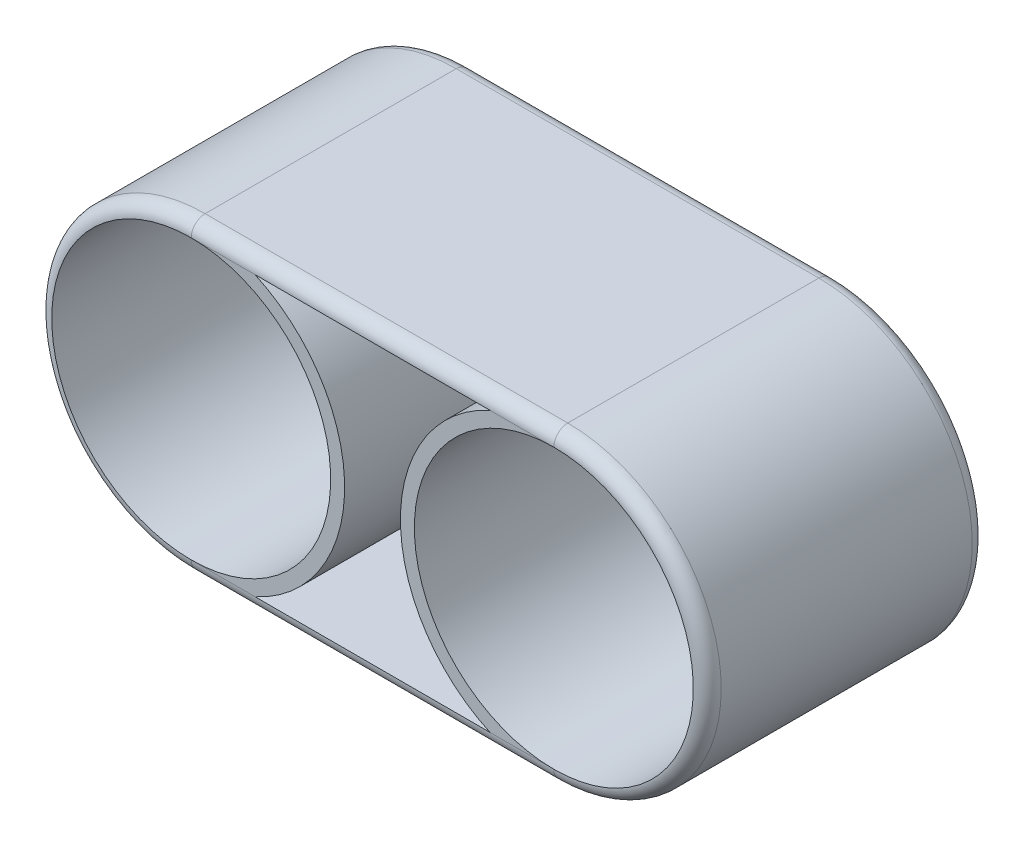
ISO-10303-21;
HEADER;
FILE_DESCRIPTION(('STEP AP214'),'2;1');
FILE_NAME('part.step','',(''),(''),'','','');
FILE_SCHEMA(('AUTOMOTIVE_DESIGN { 1 0 10303 214 1 1 1 1 }'));
ENDSEC;
DATA;
#1=APPLICATION_CONTEXT('core data for automotive mechanical design processes');
#2=APPLICATION_PROTOCOL_DEFINITION('international standard','automotive_design',2000,#1);
#3=PRODUCT_CONTEXT('',#1,'mechanical');
#4=PRODUCT('Part','Part','',(#3));
#5=PRODUCT_RELATED_PRODUCT_CATEGORY('part','',(#4));
#6=PRODUCT_DEFINITION_FORMATION('','',#4);
#7=PRODUCT_DEFINITION_CONTEXT('part definition',#1,'design');
#8=PRODUCT_DEFINITION('design','',#6,#7);
#9=PRODUCT_DEFINITION_SHAPE('','',#8);
#10=(LENGTH_UNIT() NAMED_UNIT(*) SI_UNIT(.MILLI.,.METRE.));
#11=(NAMED_UNIT(*) PLANE_ANGLE_UNIT() SI_UNIT($,.RADIAN.));
#12=(NAMED_UNIT(*) SI_UNIT($,.STERADIAN.) SOLID_ANGLE_UNIT());
#13=UNCERTAINTY_MEASURE_WITH_UNIT(LENGTH_MEASURE(1.E-05),#10,'distance_accuracy_value','');
#14=(GEOMETRIC_REPRESENTATION_CONTEXT(3) GLOBAL_UNCERTAINTY_ASSIGNED_CONTEXT((#13)) GLOBAL_UNIT_ASSIGNED_CONTEXT((#10,
#11,#12)) REPRESENTATION_CONTEXT('',''));
#15=CARTESIAN_POINT('',(0.,0.,0.));
#16=DIRECTION('',(0.,0.,1.));
#17=DIRECTION('',(1.,0.,0.));
#18=AXIS2_PLACEMENT_3D('',#15,#16,#17);
#19=CARTESIAN_POINT('',(65.,0.,50.));
#20=DIRECTION('',(0.,0.,1.));
#21=DIRECTION('',(1.,0.,0.));
#22=AXIS2_PLACEMENT_3D('',#19,#20,#21);
#23=PLANE('',#22);
#24=CARTESIAN_POINT('',(65.,0.,50.));
#25=DIRECTION('',(0.,0.,1.));
#26=DIRECTION('',(1.,0.,0.));
#27=AXIS2_PLACEMENT_3D('',#24,#25,#26);
#28=CIRCLE('',#27,50.);
#29=CARTESIAN_POINT('',(65.,50.,50.));
#30=VERTEX_POINT('',#29);
#31=CARTESIAN_POINT('',(65.,-50.,50.));
#32=VERTEX_POINT('',#31);
#33=EDGE_CURVE('E125',#30,#32,#28,.T.);
#34=ORIENTED_EDGE('',*,*,#33,.F.);
#35=DIRECTION('',(-1.,0.,0.));
#36=VECTOR('',#35,1.);
#37=CARTESIAN_POINT('',(-65.,50.,50.));
#38=LINE('',#37,#36);
#39=CARTESIAN_POINT('',(42.0871215252207,50.,50.));
#40=VERTEX_POINT('',#39);
#41=EDGE_CURVE('E122',#30,#40,#38,.T.);
#42=ORIENTED_EDGE('',*,*,#41,.T.);
#43=CARTESIAN_POINT('',(65.,0.,50.));
#44=DIRECTION('',(0.,0.,-1.));
#45=DIRECTION('',(1.,0.,0.));
#46=AXIS2_PLACEMENT_3D('',#43,#44,#45);
#47=CIRCLE('',#46,55.);
#48=CARTESIAN_POINT('',(42.0871215252208,-50.,50.));
#49=VERTEX_POINT('',#48);
#50=EDGE_CURVE('E124',#49,#40,#47,.T.);
#51=ORIENTED_EDGE('',*,*,#50,.F.);
#52=DIRECTION('',(1.,0.,0.));
#53=VECTOR('',#52,1.);
#54=CARTESIAN_POINT('',(65.,-50.,50.));
#55=LINE('',#54,#53);
#56=EDGE_CURVE('E50',#49,#32,#55,.T.);
#57=ORIENTED_EDGE('',*,*,#56,.T.);
#58=EDGE_LOOP('',(#34,#42,#51,#57));
#59=FACE_BOUND('',#58,.T.);
#60=ADVANCED_FACE('F33',(#59),#23,.T.);
#61=CARTESIAN_POINT('',(65.,0.,-50.));
#62=DIRECTION('',(0.,0.,1.));
#63=DIRECTION('',(1.,0.,0.));
#64=AXIS2_PLACEMENT_3D('',#61,#62,#63);
#65=PLANE('',#64);
#66=CARTESIAN_POINT('',(-65.,0.,-50.));
#67=DIRECTION('',(0.,0.,1.));
#68=DIRECTION('',(1.,0.,0.));
#69=AXIS2_PLACEMENT_3D('',#66,#67,#68);
#70=CIRCLE('',#69,50.);
#71=CARTESIAN_POINT('',(-65.,-50.,-50.));
#72=VERTEX_POINT('',#71);
#73=CARTESIAN_POINT('',(-65.,50.,-50.));
#74=VERTEX_POINT('',#73);
#75=EDGE_CURVE('E268',#72,#74,#70,.T.);
#76=ORIENTED_EDGE('',*,*,#75,.T.);
#77=DIRECTION('',(-1.,0.,0.));
#78=VECTOR('',#77,1.);
#79=CARTESIAN_POINT('',(65.,50.,-50.));
#80=LINE('',#79,#78);
#81=CARTESIAN_POINT('',(-42.0871215252208,50.,-50.));
#82=VERTEX_POINT('',#81);
#83=EDGE_CURVE('E201',#74,#82,#80,.F.);
#84=ORIENTED_EDGE('',*,*,#83,.T.);
#85=CARTESIAN_POINT('',(-65.,0.,-50.));
#86=DIRECTION('',(0.,0.,-1.));
#87=DIRECTION('',(1.,0.,0.));
#88=AXIS2_PLACEMENT_3D('',#85,#86,#87);
#89=CIRCLE('',#88,55.);
#90=CARTESIAN_POINT('',(-42.0871215252208,-50.,-50.));
#91=VERTEX_POINT('',#90);
#92=EDGE_CURVE('E169',#82,#91,#89,.T.);
#93=ORIENTED_EDGE('',*,*,#92,.T.);
#94=DIRECTION('',(1.,0.,0.));
#95=VECTOR('',#94,1.);
#96=CARTESIAN_POINT('',(65.,-50.,-50.));
#97=LINE('',#96,#95);
#98=EDGE_CURVE('E195',#91,#72,#97,.F.);
#99=ORIENTED_EDGE('',*,*,#98,.T.);
#100=EDGE_LOOP('',(#76,#84,#93,#99));
#101=FACE_BOUND('',#100,.T.);
#102=ADVANCED_FACE('F304',(#101),#65,.F.);
#103=CARTESIAN_POINT('',(-65.,0.,50.));
#104=DIRECTION('',(0.,0.,-1.));
#105=DIRECTION('',(1.,0.,0.));
#106=AXIS2_PLACEMENT_3D('',#103,#104,#105);
#107=CIRCLE('',#106,55.);
#108=CARTESIAN_POINT('',(-42.0871215252208,50.,50.));
#109=VERTEX_POINT('',#108);
#110=CARTESIAN_POINT('',(-42.0871215252208,-50.,50.));
#111=VERTEX_POINT('',#110);
#112=EDGE_CURVE('E157',#109,#111,#107,.T.);
#113=ORIENTED_EDGE('',*,*,#112,.F.);
#114=DIRECTION('',(-1.,0.,0.));
#115=VECTOR('',#114,1.);
#116=CARTESIAN_POINT('',(-65.,50.,50.));
#117=LINE('',#116,#115);
#118=CARTESIAN_POINT('',(-65.,50.,50.));
#119=VERTEX_POINT('',#118);
#120=EDGE_CURVE('E130',#109,#119,#117,.T.);
#121=ORIENTED_EDGE('',*,*,#120,.T.);
#122=CARTESIAN_POINT('',(-65.,0.,50.));
#123=DIRECTION('',(0.,0.,1.));
#124=DIRECTION('',(1.,0.,0.));
#125=AXIS2_PLACEMENT_3D('',#122,#123,#124);
#126=CIRCLE('',#125,50.);
#127=CARTESIAN_POINT('',(-65.,-50.,50.));
#128=VERTEX_POINT('',#127);
#129=EDGE_CURVE('E267',#128,#119,#126,.T.);
#130=ORIENTED_EDGE('',*,*,#129,.F.);
#131=DIRECTION('',(1.,0.,0.));
#132=VECTOR('',#131,1.);
#133=CARTESIAN_POINT('',(65.,-50.,50.));
#134=LINE('',#133,#132);
#135=EDGE_CURVE('E212',#128,#111,#134,.T.);
#136=ORIENTED_EDGE('',*,*,#135,.T.);
#137=EDGE_LOOP('',(#113,#121,#130,#136));
#138=FACE_BOUND('',#137,.T.);
#139=ADVANCED_FACE('F306',(#138),#23,.T.);
#140=CARTESIAN_POINT('',(65.,0.,-50.));
#141=DIRECTION('',(0.,0.,-1.));
#142=DIRECTION('',(1.,0.,0.));
#143=AXIS2_PLACEMENT_3D('',#140,#141,#142);
#144=CIRCLE('',#143,55.);
#145=CARTESIAN_POINT('',(42.0871215252208,-50.,-50.));
#146=VERTEX_POINT('',#145);
#147=CARTESIAN_POINT('',(42.0871215252207,50.,-50.));
#148=VERTEX_POINT('',#147);
#149=EDGE_CURVE('E165',#146,#148,#144,.T.);
#150=ORIENTED_EDGE('',*,*,#149,.T.);
#151=DIRECTION('',(-1.,0.,0.));
#152=VECTOR('',#151,1.);
#153=CARTESIAN_POINT('',(65.,50.,-50.));
#154=LINE('',#153,#152);
#155=CARTESIAN_POINT('',(65.,50.,-50.));
#156=VERTEX_POINT('',#155);
#157=EDGE_CURVE('E199',#148,#156,#154,.F.);
#158=ORIENTED_EDGE('',*,*,#157,.T.);
#159=CARTESIAN_POINT('',(65.,0.,-50.));
#160=DIRECTION('',(0.,0.,1.));
#161=DIRECTION('',(1.,0.,0.));
#162=AXIS2_PLACEMENT_3D('',#159,#160,#161);
#163=CIRCLE('',#162,50.);
#164=CARTESIAN_POINT('',(65.,-50.,-50.));
#165=VERTEX_POINT('',#164);
#166=EDGE_CURVE('E274',#156,#165,#163,.T.);
#167=ORIENTED_EDGE('',*,*,#166,.T.);
#168=DIRECTION('',(1.,0.,0.));
#169=VECTOR('',#168,1.);
#170=CARTESIAN_POINT('',(65.,-50.,-50.));
#171=LINE('',#170,#169);
#172=EDGE_CURVE('E197',#165,#146,#171,.F.);
#173=ORIENTED_EDGE('',*,*,#172,.T.);
#174=EDGE_LOOP('',(#150,#158,#167,#173));
#175=FACE_BOUND('',#174,.T.);
#176=ADVANCED_FACE('F301',(#175),#65,.F.);
#177=CARTESIAN_POINT('',(65.,0.,50.));
#178=DIRECTION('',(0.,0.,-1.));
#179=DIRECTION('',(-1.,0.,0.));
#180=AXIS2_PLACEMENT_3D('',#177,#178,#179);
#181=CYLINDRICAL_SURFACE('',#180,55.);
#182=DIRECTION('',(0.,0.,-1.));
#183=VECTOR('',#182,1.);
#184=CARTESIAN_POINT('',(65.,-55.,50.));
#185=LINE('',#184,#183);
#186=CARTESIAN_POINT('',(65.,-55.,45.));
#187=VERTEX_POINT('',#186);
#188=CARTESIAN_POINT('',(65.,-55.,-45.));
#189=VERTEX_POINT('',#188);
#190=EDGE_CURVE('E151',#187,#189,#185,.T.);
#191=ORIENTED_EDGE('',*,*,#190,.T.);
#192=CARTESIAN_POINT('',(65.,0.,-45.));
#193=DIRECTION('',(0.,0.,1.));
#194=DIRECTION('',(1.,0.,0.));
#195=AXIS2_PLACEMENT_3D('',#192,#193,#194);
#196=CIRCLE('',#195,55.);
#197=CARTESIAN_POINT('',(65.,55.,-45.));
#198=VERTEX_POINT('',#197);
#199=EDGE_CURVE('E209',#189,#198,#196,.T.);
#200=ORIENTED_EDGE('',*,*,#199,.T.);
#201=DIRECTION('',(0.,0.,-1.));
#202=VECTOR('',#201,1.);
#203=CARTESIAN_POINT('',(65.,55.,50.));
#204=LINE('',#203,#202);
#205=CARTESIAN_POINT('',(65.,55.,45.));
#206=VERTEX_POINT('',#205);
#207=EDGE_CURVE('E186',#206,#198,#204,.T.);
#208=ORIENTED_EDGE('',*,*,#207,.F.);
#209=CARTESIAN_POINT('',(65.,0.,45.));
#210=DIRECTION('',(0.,0.,1.));
#211=DIRECTION('',(1.,0.,0.));
#212=AXIS2_PLACEMENT_3D('',#209,#210,#211);
#213=CIRCLE('',#212,55.);
#214=EDGE_CURVE('E207',#206,#187,#213,.F.);
#215=ORIENTED_EDGE('',*,*,#214,.T.);
#216=EDGE_LOOP('',(#191,#200,#208,#215));
#217=FACE_BOUND('',#216,.T.);
#218=ADVANCED_FACE('F241',(#217),#181,.T.);
#219=CARTESIAN_POINT('',(-65.,55.,50.));
#220=DIRECTION('',(0.,-1.,0.));
#221=DIRECTION('',(1.,0.,0.));
#222=AXIS2_PLACEMENT_3D('',#219,#220,#221);
#223=PLANE('',#222);
#224=ORIENTED_EDGE('',*,*,#207,.T.);
#225=DIRECTION('',(-1.,0.,0.));
#226=VECTOR('',#225,1.);
#227=CARTESIAN_POINT('',(-65.,55.,-45.));
#228=LINE('',#227,#226);
#229=CARTESIAN_POINT('',(-65.,55.,-45.));
#230=VERTEX_POINT('',#229);
#231=EDGE_CURVE('E205',#198,#230,#228,.T.);
#232=ORIENTED_EDGE('',*,*,#231,.T.);
#233=DIRECTION('',(0.,0.,-1.));
#234=VECTOR('',#233,1.);
#235=CARTESIAN_POINT('',(-65.,55.,50.));
#236=LINE('',#235,#234);
#237=CARTESIAN_POINT('',(-65.,55.,45.));
#238=VERTEX_POINT('',#237);
#239=EDGE_CURVE('E183',#238,#230,#236,.T.);
#240=ORIENTED_EDGE('',*,*,#239,.F.);
#241=DIRECTION('',(-1.,0.,0.));
#242=VECTOR('',#241,1.);
#243=CARTESIAN_POINT('',(65.,55.,45.));
#244=LINE('',#243,#242);
#245=EDGE_CURVE('E203',#238,#206,#244,.F.);
#246=ORIENTED_EDGE('',*,*,#245,.T.);
#247=EDGE_LOOP('',(#224,#232,#240,#246));
#248=FACE_BOUND('',#247,.T.);
#249=ADVANCED_FACE('F293',(#248),#223,.F.);
#250=CARTESIAN_POINT('',(-65.,0.,50.));
#251=DIRECTION('',(0.,0.,-1.));
#252=DIRECTION('',(-1.,0.,0.));
#253=AXIS2_PLACEMENT_3D('',#250,#251,#252);
#254=CYLINDRICAL_SURFACE('',#253,55.);
#255=ORIENTED_EDGE('',*,*,#239,.T.);
#256=CARTESIAN_POINT('',(-65.,0.,-45.));
#257=DIRECTION('',(0.,0.,1.));
#258=DIRECTION('',(1.,0.,0.));
#259=AXIS2_PLACEMENT_3D('',#256,#257,#258);
#260=CIRCLE('',#259,55.);
#261=CARTESIAN_POINT('',(-65.,-55.,-45.));
#262=VERTEX_POINT('',#261);
#263=EDGE_CURVE('E192',#230,#262,#260,.T.);
#264=ORIENTED_EDGE('',*,*,#263,.T.);
#265=DIRECTION('',(0.,0.,-1.));
#266=VECTOR('',#265,1.);
#267=CARTESIAN_POINT('',(-65.,-55.,50.));
#268=LINE('',#267,#266);
#269=CARTESIAN_POINT('',(-65.,-55.,45.));
#270=VERTEX_POINT('',#269);
#271=EDGE_CURVE('E180',#270,#262,#268,.T.);
#272=ORIENTED_EDGE('',*,*,#271,.F.);
#273=CARTESIAN_POINT('',(-65.,0.,45.));
#274=DIRECTION('',(0.,0.,1.));
#275=DIRECTION('',(1.,0.,0.));
#276=AXIS2_PLACEMENT_3D('',#273,#274,#275);
#277=CIRCLE('',#276,55.);
#278=EDGE_CURVE('E189',#270,#238,#277,.F.);
#279=ORIENTED_EDGE('',*,*,#278,.T.);
#280=EDGE_LOOP('',(#255,#264,#272,#279));
#281=FACE_BOUND('',#280,.T.);
#282=ADVANCED_FACE('F255',(#281),#254,.T.);
#283=CARTESIAN_POINT('',(65.,-55.,50.));
#284=DIRECTION('',(0.,1.,0.));
#285=DIRECTION('',(-1.,0.,0.));
#286=AXIS2_PLACEMENT_3D('',#283,#284,#285);
#287=PLANE('',#286);
#288=ORIENTED_EDGE('',*,*,#271,.T.);
#289=DIRECTION('',(1.,0.,0.));
#290=VECTOR('',#289,1.);
#291=CARTESIAN_POINT('',(65.,-55.,-45.));
#292=LINE('',#291,#290);
#293=EDGE_CURVE('E11',#262,#189,#292,.T.);
#294=ORIENTED_EDGE('',*,*,#293,.T.);
#295=ORIENTED_EDGE('',*,*,#190,.F.);
#296=DIRECTION('',(1.,0.,0.));
#297=VECTOR('',#296,1.);
#298=CARTESIAN_POINT('',(-65.,-55.,45.));
#299=LINE('',#298,#297);
#300=EDGE_CURVE('E42',#187,#270,#299,.F.);
#301=ORIENTED_EDGE('',*,*,#300,.T.);
#302=EDGE_LOOP('',(#288,#294,#295,#301));
#303=FACE_BOUND('',#302,.T.);
#304=ADVANCED_FACE('F244',(#303),#287,.F.);
#305=CARTESIAN_POINT('',(65.,0.,50.));
#306=DIRECTION('',(0.,0.,-1.));
#307=DIRECTION('',(-1.,0.,0.));
#308=AXIS2_PLACEMENT_3D('',#305,#306,#307);
#309=CYLINDRICAL_SURFACE('',#308,55.);
#310=ORIENTED_EDGE('',*,*,#149,.F.);
#311=DIRECTION('',(0.,0.,-1.));
#312=VECTOR('',#311,1.);
#313=CARTESIAN_POINT('',(42.0871215252208,-50.,50.));
#314=LINE('',#313,#312);
#315=EDGE_CURVE('E141',#49,#146,#314,.T.);
#316=ORIENTED_EDGE('',*,*,#315,.F.);
#317=ORIENTED_EDGE('',*,*,#50,.T.);
#318=DIRECTION('',(0.,0.,-1.));
#319=VECTOR('',#318,1.);
#320=CARTESIAN_POINT('',(42.0871215252207,50.,50.));
#321=LINE('',#320,#319);
#322=EDGE_CURVE('E138',#40,#148,#321,.T.);
#323=ORIENTED_EDGE('',*,*,#322,.T.);
#324=EDGE_LOOP('',(#310,#316,#317,#323));
#325=FACE_BOUND('',#324,.T.);
#326=ADVANCED_FACE('F137',(#325),#309,.T.);
#327=CARTESIAN_POINT('',(-42.0871215252208,50.,50.));
#328=DIRECTION('',(0.,-1.,0.));
#329=DIRECTION('',(1.,0.,0.));
#330=AXIS2_PLACEMENT_3D('',#327,#328,#329);
#331=PLANE('',#330);
#332=DIRECTION('',(-1.,0.,0.));
#333=VECTOR('',#332,1.);
#334=CARTESIAN_POINT('',(-42.0871215252208,50.,-50.));
#335=LINE('',#334,#333);
#336=EDGE_CURVE('E150',#148,#82,#335,.T.);
#337=ORIENTED_EDGE('',*,*,#336,.F.);
#338=ORIENTED_EDGE('',*,*,#322,.F.);
#339=DIRECTION('',(-1.,0.,0.));
#340=VECTOR('',#339,1.);
#341=CARTESIAN_POINT('',(-42.0871215252208,50.,50.));
#342=LINE('',#341,#340);
#343=EDGE_CURVE('E142',#40,#109,#342,.T.);
#344=ORIENTED_EDGE('',*,*,#343,.T.);
#345=DIRECTION('',(0.,0.,-1.));
#346=VECTOR('',#345,1.);
#347=CARTESIAN_POINT('',(-42.0871215252208,50.,50.));
#348=LINE('',#347,#346);
#349=EDGE_CURVE('E152',#109,#82,#348,.T.);
#350=ORIENTED_EDGE('',*,*,#349,.T.);
#351=EDGE_LOOP('',(#337,#338,#344,#350));
#352=FACE_BOUND('',#351,.T.);
#353=ADVANCED_FACE('F146',(#352),#331,.T.);
#354=CARTESIAN_POINT('',(-65.,0.,50.));
#355=DIRECTION('',(0.,0.,-1.));
#356=DIRECTION('',(-1.,0.,0.));
#357=AXIS2_PLACEMENT_3D('',#354,#355,#356);
#358=CYLINDRICAL_SURFACE('',#357,55.);
#359=ORIENTED_EDGE('',*,*,#92,.F.);
#360=ORIENTED_EDGE('',*,*,#349,.F.);
#361=ORIENTED_EDGE('',*,*,#112,.T.);
#362=DIRECTION('',(0.,0.,-1.));
#363=VECTOR('',#362,1.);
#364=CARTESIAN_POINT('',(-42.0871215252208,-50.,50.));
#365=LINE('',#364,#363);
#366=EDGE_CURVE('E175',#111,#91,#365,.T.);
#367=ORIENTED_EDGE('',*,*,#366,.T.);
#368=EDGE_LOOP('',(#359,#360,#361,#367));
#369=FACE_BOUND('',#368,.T.);
#370=ADVANCED_FACE('F325',(#369),#358,.T.);
#371=CARTESIAN_POINT('',(42.0871215252208,-50.,50.));
#372=DIRECTION('',(0.,1.,0.));
#373=DIRECTION('',(-1.,0.,0.));
#374=AXIS2_PLACEMENT_3D('',#371,#372,#373);
#375=PLANE('',#374);
#376=DIRECTION('',(1.,0.,0.));
#377=VECTOR('',#376,1.);
#378=CARTESIAN_POINT('',(42.0871215252208,-50.,-50.));
#379=LINE('',#378,#377);
#380=EDGE_CURVE('E143',#91,#146,#379,.T.);
#381=ORIENTED_EDGE('',*,*,#380,.F.);
#382=ORIENTED_EDGE('',*,*,#366,.F.);
#383=DIRECTION('',(1.,0.,0.));
#384=VECTOR('',#383,1.);
#385=CARTESIAN_POINT('',(42.0871215252208,-50.,50.));
#386=LINE('',#385,#384);
#387=EDGE_CURVE('E160',#111,#49,#386,.T.);
#388=ORIENTED_EDGE('',*,*,#387,.T.);
#389=ORIENTED_EDGE('',*,*,#315,.T.);
#390=EDGE_LOOP('',(#381,#382,#388,#389));
#391=FACE_BOUND('',#390,.T.);
#392=ADVANCED_FACE('F330',(#391),#375,.T.);
#393=CARTESIAN_POINT('',(-65.,0.,50.));
#394=DIRECTION('',(0.,0.,-1.));
#395=DIRECTION('',(-1.,0.,0.));
#396=AXIS2_PLACEMENT_3D('',#393,#394,#395);
#397=CYLINDRICAL_SURFACE('',#396,50.);
#398=EDGE_CURVE('E167',#119,#128,#126,.T.);
#399=ORIENTED_EDGE('',*,*,#398,.T.);
#400=ORIENTED_EDGE('',*,*,#129,.T.);
#401=EDGE_LOOP('',(#399,#400));
#402=FACE_BOUND('',#401,.T.);
#403=EDGE_CURVE('E264',#74,#72,#70,.T.);
#404=ORIENTED_EDGE('',*,*,#403,.F.);
#405=ORIENTED_EDGE('',*,*,#75,.F.);
#406=EDGE_LOOP('',(#404,#405));
#407=FACE_BOUND('',#406,.T.);
#408=ADVANCED_FACE('F281',(#402,#407),#397,.F.);
#409=CARTESIAN_POINT('',(65.,0.,50.));
#410=DIRECTION('',(0.,0.,-1.));
#411=DIRECTION('',(-1.,0.,0.));
#412=AXIS2_PLACEMENT_3D('',#409,#410,#411);
#413=CYLINDRICAL_SURFACE('',#412,50.);
#414=ORIENTED_EDGE('',*,*,#33,.T.);
#415=EDGE_CURVE('E56',#32,#30,#28,.T.);
#416=ORIENTED_EDGE('',*,*,#415,.T.);
#417=EDGE_LOOP('',(#414,#416));
#418=FACE_BOUND('',#417,.T.);
#419=ORIENTED_EDGE('',*,*,#166,.F.);
#420=EDGE_CURVE('E226',#165,#156,#163,.T.);
#421=ORIENTED_EDGE('',*,*,#420,.F.);
#422=EDGE_LOOP('',(#419,#421));
#423=FACE_BOUND('',#422,.T.);
#424=ADVANCED_FACE('F277',(#418,#423),#413,.F.);
#425=CARTESIAN_POINT('',(65.,0.,-45.));
#426=DIRECTION('',(0.,0.,1.));
#427=DIRECTION('',(1.,0.,0.));
#428=AXIS2_PLACEMENT_3D('',#425,#426,#427);
#429=TOROIDAL_SURFACE('',#428,50.,5.);
#430=CARTESIAN_POINT('',(65.,-50.,-45.));
#431=DIRECTION('',(-1.,0.,0.));
#432=DIRECTION('',(0.,0.,1.));
#433=AXIS2_PLACEMENT_3D('',#430,#431,#432);
#434=CIRCLE('',#433,5.);
#435=EDGE_CURVE('E220',#165,#189,#434,.T.);
#436=ORIENTED_EDGE('',*,*,#435,.F.);
#437=ORIENTED_EDGE('',*,*,#420,.T.);
#438=CARTESIAN_POINT('',(65.,50.,-45.));
#439=DIRECTION('',(-1.,0.,0.));
#440=DIRECTION('',(0.,0.,1.));
#441=AXIS2_PLACEMENT_3D('',#438,#439,#440);
#442=CIRCLE('',#441,5.);
#443=EDGE_CURVE('E223',#198,#156,#442,.T.);
#444=ORIENTED_EDGE('',*,*,#443,.F.);
#445=ORIENTED_EDGE('',*,*,#199,.F.);
#446=EDGE_LOOP('',(#436,#437,#444,#445));
#447=FACE_BOUND('',#446,.T.);
#448=ADVANCED_FACE('F280',(#447),#429,.T.);
#449=CARTESIAN_POINT('',(-65.,50.,-45.));
#450=DIRECTION('',(-1.,0.,0.));
#451=DIRECTION('',(0.,-1.,0.));
#452=AXIS2_PLACEMENT_3D('',#449,#450,#451);
#453=CYLINDRICAL_SURFACE('',#452,5.);
#454=ORIENTED_EDGE('',*,*,#336,.T.);
#455=ORIENTED_EDGE('',*,*,#83,.F.);
#456=CARTESIAN_POINT('',(-65.,50.,-45.));
#457=DIRECTION('',(-1.,0.,0.));
#458=DIRECTION('',(0.,0.,1.));
#459=AXIS2_PLACEMENT_3D('',#456,#457,#458);
#460=CIRCLE('',#459,5.);
#461=EDGE_CURVE('E218',#230,#74,#460,.T.);
#462=ORIENTED_EDGE('',*,*,#461,.F.);
#463=ORIENTED_EDGE('',*,*,#231,.F.);
#464=ORIENTED_EDGE('',*,*,#443,.T.);
#465=ORIENTED_EDGE('',*,*,#157,.F.);
#466=EDGE_LOOP('',(#454,#455,#462,#463,#464,#465));
#467=FACE_BOUND('',#466,.T.);
#468=ADVANCED_FACE('F291',(#467),#453,.T.);
#469=CARTESIAN_POINT('',(65.,-50.,-45.));
#470=DIRECTION('',(1.,0.,0.));
#471=DIRECTION('',(0.,1.,0.));
#472=AXIS2_PLACEMENT_3D('',#469,#470,#471);
#473=CYLINDRICAL_SURFACE('',#472,5.);
#474=ORIENTED_EDGE('',*,*,#435,.T.);
#475=ORIENTED_EDGE('',*,*,#293,.F.);
#476=CARTESIAN_POINT('',(-65.,-50.,-45.));
#477=DIRECTION('',(-1.,0.,0.));
#478=DIRECTION('',(0.,0.,1.));
#479=AXIS2_PLACEMENT_3D('',#476,#477,#478);
#480=CIRCLE('',#479,5.);
#481=EDGE_CURVE('E216',#72,#262,#480,.T.);
#482=ORIENTED_EDGE('',*,*,#481,.F.);
#483=ORIENTED_EDGE('',*,*,#98,.F.);
#484=ORIENTED_EDGE('',*,*,#380,.T.);
#485=ORIENTED_EDGE('',*,*,#172,.F.);
#486=EDGE_LOOP('',(#474,#475,#482,#483,#484,#485));
#487=FACE_BOUND('',#486,.T.);
#488=ADVANCED_FACE('F249',(#487),#473,.T.);
#489=CARTESIAN_POINT('',(-65.,0.,-45.));
#490=DIRECTION('',(0.,0.,1.));
#491=DIRECTION('',(1.,0.,0.));
#492=AXIS2_PLACEMENT_3D('',#489,#490,#491);
#493=TOROIDAL_SURFACE('',#492,50.,5.);
#494=ORIENTED_EDGE('',*,*,#461,.T.);
#495=ORIENTED_EDGE('',*,*,#403,.T.);
#496=ORIENTED_EDGE('',*,*,#481,.T.);
#497=ORIENTED_EDGE('',*,*,#263,.F.);
#498=EDGE_LOOP('',(#494,#495,#496,#497));
#499=FACE_BOUND('',#498,.T.);
#500=ADVANCED_FACE('F260',(#499),#493,.T.);
#501=CARTESIAN_POINT('',(65.,0.,45.));
#502=DIRECTION('',(0.,0.,1.));
#503=DIRECTION('',(1.,0.,0.));
#504=AXIS2_PLACEMENT_3D('',#501,#502,#503);
#505=TOROIDAL_SURFACE('',#504,50.,5.);
#506=CARTESIAN_POINT('',(65.,-50.,45.));
#507=DIRECTION('',(-1.,0.,0.));
#508=DIRECTION('',(0.,0.,1.));
#509=AXIS2_PLACEMENT_3D('',#506,#507,#508);
#510=CIRCLE('',#509,5.);
#511=EDGE_CURVE('E230',#187,#32,#510,.T.);
#512=ORIENTED_EDGE('',*,*,#511,.F.);
#513=ORIENTED_EDGE('',*,*,#214,.F.);
#514=CARTESIAN_POINT('',(65.,50.,45.));
#515=DIRECTION('',(-1.,0.,0.));
#516=DIRECTION('',(0.,0.,1.));
#517=AXIS2_PLACEMENT_3D('',#514,#515,#516);
#518=CIRCLE('',#517,5.);
#519=EDGE_CURVE('E37',#30,#206,#518,.T.);
#520=ORIENTED_EDGE('',*,*,#519,.F.);
#521=ORIENTED_EDGE('',*,*,#415,.F.);
#522=EDGE_LOOP('',(#512,#513,#520,#521));
#523=FACE_BOUND('',#522,.T.);
#524=ADVANCED_FACE('F35',(#523),#505,.T.);
#525=CARTESIAN_POINT('',(65.,50.,45.));
#526=DIRECTION('',(1.,0.,0.));
#527=DIRECTION('',(0.,1.,0.));
#528=AXIS2_PLACEMENT_3D('',#525,#526,#527);
#529=CYLINDRICAL_SURFACE('',#528,5.);
#530=ORIENTED_EDGE('',*,*,#519,.T.);
#531=ORIENTED_EDGE('',*,*,#245,.F.);
#532=CARTESIAN_POINT('',(-65.,50.,45.));
#533=DIRECTION('',(-1.,0.,0.));
#534=DIRECTION('',(0.,0.,1.));
#535=AXIS2_PLACEMENT_3D('',#532,#533,#534);
#536=CIRCLE('',#535,5.);
#537=EDGE_CURVE('E229',#119,#238,#536,.T.);
#538=ORIENTED_EDGE('',*,*,#537,.F.);
#539=ORIENTED_EDGE('',*,*,#120,.F.);
#540=ORIENTED_EDGE('',*,*,#343,.F.);
#541=ORIENTED_EDGE('',*,*,#41,.F.);
#542=EDGE_LOOP('',(#530,#531,#538,#539,#540,#541));
#543=FACE_BOUND('',#542,.T.);
#544=ADVANCED_FACE('F155',(#543),#529,.T.);
#545=CARTESIAN_POINT('',(65.,-50.,45.));
#546=DIRECTION('',(-1.,0.,0.));
#547=DIRECTION('',(0.,-1.,0.));
#548=AXIS2_PLACEMENT_3D('',#545,#546,#547);
#549=CYLINDRICAL_SURFACE('',#548,5.);
#550=ORIENTED_EDGE('',*,*,#387,.F.);
#551=ORIENTED_EDGE('',*,*,#135,.F.);
#552=CARTESIAN_POINT('',(-65.,-50.,45.));
#553=DIRECTION('',(-1.,0.,0.));
#554=DIRECTION('',(0.,0.,1.));
#555=AXIS2_PLACEMENT_3D('',#552,#553,#554);
#556=CIRCLE('',#555,5.);
#557=EDGE_CURVE('E227',#270,#128,#556,.T.);
#558=ORIENTED_EDGE('',*,*,#557,.F.);
#559=ORIENTED_EDGE('',*,*,#300,.F.);
#560=ORIENTED_EDGE('',*,*,#511,.T.);
#561=ORIENTED_EDGE('',*,*,#56,.F.);
#562=EDGE_LOOP('',(#550,#551,#558,#559,#560,#561));
#563=FACE_BOUND('',#562,.T.);
#564=ADVANCED_FACE('F327',(#563),#549,.T.);
#565=CARTESIAN_POINT('',(-65.,0.,45.));
#566=DIRECTION('',(0.,0.,1.));
#567=DIRECTION('',(1.,0.,0.));
#568=AXIS2_PLACEMENT_3D('',#565,#566,#567);
#569=TOROIDAL_SURFACE('',#568,50.,5.);
#570=ORIENTED_EDGE('',*,*,#537,.T.);
#571=ORIENTED_EDGE('',*,*,#278,.F.);
#572=ORIENTED_EDGE('',*,*,#557,.T.);
#573=ORIENTED_EDGE('',*,*,#398,.F.);
#574=EDGE_LOOP('',(#570,#571,#572,#573));
#575=FACE_BOUND('',#574,.T.);
#576=ADVANCED_FACE('F435',(#575),#569,.T.);
#577=CLOSED_SHELL('',(#60,#102,#139,#176,#218,#249,#282,#304,#326,#353,#370,#392,#408,#424,#448,
#468,#488,#500,#524,#544,#564,#576));
#578=MANIFOLD_SOLID_BREP('B2',#577);
#579=ADVANCED_BREP_SHAPE_REPRESENTATION('',(#18,#578),#14);
#580=SHAPE_DEFINITION_REPRESENTATION(#9,#579);
ENDSEC;
END-ISO-10303-21;
